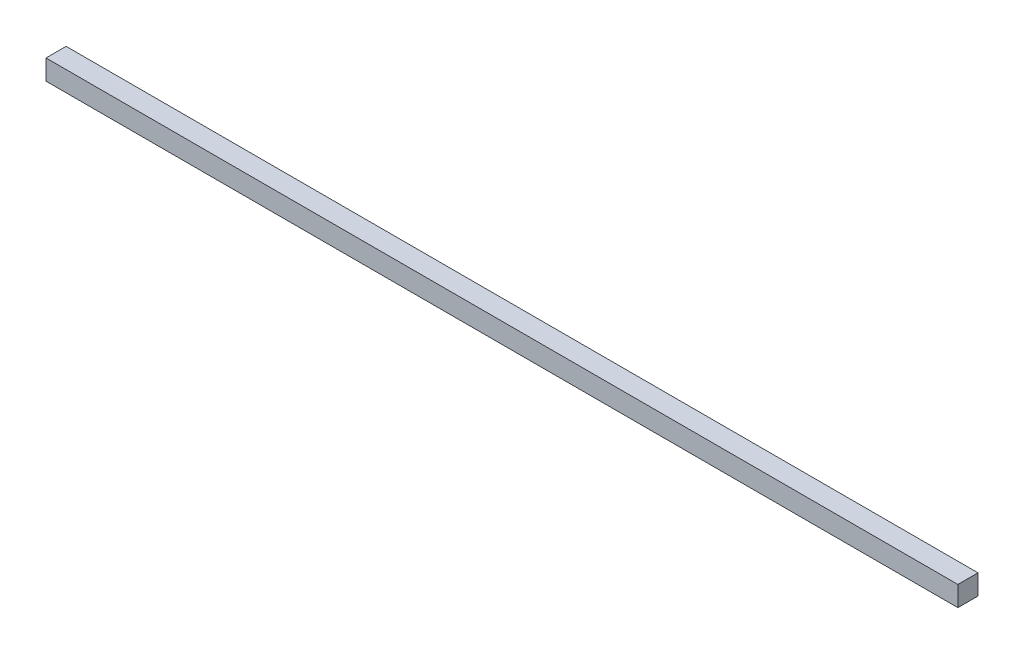
ISO-10303-21;
HEADER;
FILE_DESCRIPTION(('STEP AP214'),'2;1');
FILE_NAME('part.step','',(''),(''),'','','');
FILE_SCHEMA(('AUTOMOTIVE_DESIGN { 1 0 10303 214 1 1 1 1 }'));
ENDSEC;
DATA;
#1=APPLICATION_CONTEXT('core data for automotive mechanical design processes');
#2=APPLICATION_PROTOCOL_DEFINITION('international standard','automotive_design',2000,#1);
#3=PRODUCT_CONTEXT('',#1,'mechanical');
#4=PRODUCT('Part','Part','',(#3));
#5=PRODUCT_RELATED_PRODUCT_CATEGORY('part','',(#4));
#6=PRODUCT_DEFINITION_FORMATION('','',#4);
#7=PRODUCT_DEFINITION_CONTEXT('part definition',#1,'design');
#8=PRODUCT_DEFINITION('design','',#6,#7);
#9=PRODUCT_DEFINITION_SHAPE('','',#8);
#10=(LENGTH_UNIT() NAMED_UNIT(*) SI_UNIT(.MILLI.,.METRE.));
#11=(NAMED_UNIT(*) PLANE_ANGLE_UNIT() SI_UNIT($,.RADIAN.));
#12=(NAMED_UNIT(*) SI_UNIT($,.STERADIAN.) SOLID_ANGLE_UNIT());
#13=UNCERTAINTY_MEASURE_WITH_UNIT(LENGTH_MEASURE(1.E-05),#10,'distance_accuracy_value','');
#14=(GEOMETRIC_REPRESENTATION_CONTEXT(3) GLOBAL_UNCERTAINTY_ASSIGNED_CONTEXT((#13)) GLOBAL_UNIT_ASSIGNED_CONTEXT((#10,
#11,#12)) REPRESENTATION_CONTEXT('',''));
#15=CARTESIAN_POINT('',(0.,0.,0.));
#16=DIRECTION('',(0.,0.,1.));
#17=DIRECTION('',(1.,0.,0.));
#18=AXIS2_PLACEMENT_3D('',#15,#16,#17);
#19=CARTESIAN_POINT('',(52.6371308016878,-0.0100000000000031,-44.8481012658228));
#20=DIRECTION('',(0.,0.,1.));
#21=DIRECTION('',(1.,0.,0.));
#22=AXIS2_PLACEMENT_3D('',#19,#20,#21);
#23=PLANE('',#22);
#24=DIRECTION('',(0.,1.,0.));
#25=VECTOR('',#24,1.);
#26=CARTESIAN_POINT('',(-83.3544303797469,-0.0100000000000031,-44.8481012658228));
#27=LINE('',#26,#25);
#28=CARTESIAN_POINT('',(-83.3544303797469,0.,-44.8481012658228));
#29=VERTEX_POINT('',#28);
#30=CARTESIAN_POINT('',(-83.3544303797469,3.,-44.8481012658228));
#31=VERTEX_POINT('',#30);
#32=EDGE_CURVE('E11',#29,#31,#27,.T.);
#33=ORIENTED_EDGE('',*,*,#32,.F.);
#34=DIRECTION('',(1.,0.,0.));
#35=VECTOR('',#34,1.);
#36=CARTESIAN_POINT('',(0.,0.,-44.8481012658228));
#37=LINE('',#36,#35);
#38=CARTESIAN_POINT('',(52.6371308016878,0.,-44.8481012658228));
#39=VERTEX_POINT('',#38);
#40=EDGE_CURVE('E36',#29,#39,#37,.T.);
#41=ORIENTED_EDGE('',*,*,#40,.T.);
#42=DIRECTION('',(0.,1.,0.));
#43=VECTOR('',#42,1.);
#44=CARTESIAN_POINT('',(52.6371308016878,-0.0100000000000031,-44.8481012658228));
#45=LINE('',#44,#43);
#46=CARTESIAN_POINT('',(52.6371308016878,3.,-44.8481012658228));
#47=VERTEX_POINT('',#46);
#48=EDGE_CURVE('E41',#39,#47,#45,.T.);
#49=ORIENTED_EDGE('',*,*,#48,.T.);
#50=DIRECTION('',(1.,0.,0.));
#51=VECTOR('',#50,1.);
#52=CARTESIAN_POINT('',(0.,3.,-44.8481012658228));
#53=LINE('',#52,#51);
#54=EDGE_CURVE('E95',#31,#47,#53,.T.);
#55=ORIENTED_EDGE('',*,*,#54,.F.);
#56=EDGE_LOOP('',(#33,#41,#49,#55));
#57=FACE_BOUND('',#56,.T.);
#58=ADVANCED_FACE('F32',(#57),#23,.T.);
#59=CARTESIAN_POINT('',(-83.3544303797469,-0.0100000000000031,-44.8481012658228));
#60=DIRECTION('',(-1.,0.,0.));
#61=DIRECTION('',(0.,0.,1.));
#62=AXIS2_PLACEMENT_3D('',#59,#60,#61);
#63=PLANE('',#62);
#64=DIRECTION('',(0.,-1.,0.));
#65=VECTOR('',#64,1.);
#66=CARTESIAN_POINT('',(-83.3544303797469,50.,-47.8481012658228));
#67=LINE('',#66,#65);
#68=CARTESIAN_POINT('',(-83.3544303797469,3.,-47.8481012658228));
#69=VERTEX_POINT('',#68);
#70=CARTESIAN_POINT('',(-83.3544303797469,0.,-47.8481012658228));
#71=VERTEX_POINT('',#70);
#72=EDGE_CURVE('E89',#69,#71,#67,.T.);
#73=ORIENTED_EDGE('',*,*,#72,.T.);
#74=DIRECTION('',(0.,0.,1.));
#75=VECTOR('',#74,1.);
#76=CARTESIAN_POINT('',(-83.3544303797469,0.,0.));
#77=LINE('',#76,#75);
#78=EDGE_CURVE('E78',#71,#29,#77,.T.);
#79=ORIENTED_EDGE('',*,*,#78,.T.);
#80=ORIENTED_EDGE('',*,*,#32,.T.);
#81=DIRECTION('',(0.,0.,1.));
#82=VECTOR('',#81,1.);
#83=CARTESIAN_POINT('',(-83.3544303797469,3.,0.));
#84=LINE('',#83,#82);
#85=EDGE_CURVE('E99',#69,#31,#84,.T.);
#86=ORIENTED_EDGE('',*,*,#85,.F.);
#87=EDGE_LOOP('',(#73,#79,#80,#86));
#88=FACE_BOUND('',#87,.T.);
#89=ADVANCED_FACE('F106',(#88),#63,.T.);
#90=CARTESIAN_POINT('',(52.6371308016878,-0.0100000000000031,-44.8481012658228));
#91=DIRECTION('',(1.,0.,0.));
#92=DIRECTION('',(0.,0.,-1.));
#93=AXIS2_PLACEMENT_3D('',#90,#91,#92);
#94=PLANE('',#93);
#95=ORIENTED_EDGE('',*,*,#48,.F.);
#96=DIRECTION('',(0.,0.,-1.));
#97=VECTOR('',#96,1.);
#98=CARTESIAN_POINT('',(52.6371308016878,0.,0.));
#99=LINE('',#98,#97);
#100=CARTESIAN_POINT('',(52.6371308016878,0.,-47.8481012658228));
#101=VERTEX_POINT('',#100);
#102=EDGE_CURVE('E76',#39,#101,#99,.T.);
#103=ORIENTED_EDGE('',*,*,#102,.T.);
#104=DIRECTION('',(0.,1.,0.));
#105=VECTOR('',#104,1.);
#106=CARTESIAN_POINT('',(52.6371308016878,-0.0100000000000031,-47.8481012658228));
#107=LINE('',#106,#105);
#108=CARTESIAN_POINT('',(52.6371308016878,3.,-47.8481012658228));
#109=VERTEX_POINT('',#108);
#110=EDGE_CURVE('E85',#101,#109,#107,.T.);
#111=ORIENTED_EDGE('',*,*,#110,.T.);
#112=DIRECTION('',(0.,0.,-1.));
#113=VECTOR('',#112,1.);
#114=CARTESIAN_POINT('',(52.6371308016878,3.,0.));
#115=LINE('',#114,#113);
#116=EDGE_CURVE('E88',#47,#109,#115,.T.);
#117=ORIENTED_EDGE('',*,*,#116,.F.);
#118=EDGE_LOOP('',(#95,#103,#111,#117));
#119=FACE_BOUND('',#118,.T.);
#120=ADVANCED_FACE('F91',(#119),#94,.T.);
#121=CARTESIAN_POINT('',(0.,0.,0.));
#122=DIRECTION('',(0.,1.,0.));
#123=DIRECTION('',(0.,0.,1.));
#124=AXIS2_PLACEMENT_3D('',#121,#122,#123);
#125=PLANE('',#124);
#126=ORIENTED_EDGE('',*,*,#102,.F.);
#127=ORIENTED_EDGE('',*,*,#40,.F.);
#128=ORIENTED_EDGE('',*,*,#78,.F.);
#129=DIRECTION('',(-1.,0.,0.));
#130=VECTOR('',#129,1.);
#131=CARTESIAN_POINT('',(-98.3544303797468,0.,-47.8481012658228));
#132=LINE('',#131,#130);
#133=EDGE_CURVE('E73',#101,#71,#132,.T.);
#134=ORIENTED_EDGE('',*,*,#133,.F.);
#135=EDGE_LOOP('',(#126,#127,#128,#134));
#136=FACE_BOUND('',#135,.T.);
#137=ADVANCED_FACE('F75',(#136),#125,.F.);
#138=CARTESIAN_POINT('',(-98.3544303797468,50.,-47.8481012658228));
#139=DIRECTION('',(0.,0.,1.));
#140=DIRECTION('',(1.,0.,0.));
#141=AXIS2_PLACEMENT_3D('',#138,#139,#140);
#142=PLANE('',#141);
#143=ORIENTED_EDGE('',*,*,#110,.F.);
#144=ORIENTED_EDGE('',*,*,#133,.T.);
#145=ORIENTED_EDGE('',*,*,#72,.F.);
#146=DIRECTION('',(1.,0.,0.));
#147=VECTOR('',#146,1.);
#148=CARTESIAN_POINT('',(-98.3544303797468,3.,-47.8481012658228));
#149=LINE('',#148,#147);
#150=EDGE_CURVE('E82',#69,#109,#149,.T.);
#151=ORIENTED_EDGE('',*,*,#150,.T.);
#152=EDGE_LOOP('',(#143,#144,#145,#151));
#153=FACE_BOUND('',#152,.T.);
#154=ADVANCED_FACE('F86',(#153),#142,.F.);
#155=CARTESIAN_POINT('',(0.,3.,0.));
#156=DIRECTION('',(0.,1.,0.));
#157=DIRECTION('',(0.,0.,1.));
#158=AXIS2_PLACEMENT_3D('',#155,#156,#157);
#159=PLANE('',#158);
#160=ORIENTED_EDGE('',*,*,#54,.T.);
#161=ORIENTED_EDGE('',*,*,#116,.T.);
#162=ORIENTED_EDGE('',*,*,#150,.F.);
#163=ORIENTED_EDGE('',*,*,#85,.T.);
#164=EDGE_LOOP('',(#160,#161,#162,#163));
#165=FACE_BOUND('',#164,.T.);
#166=ADVANCED_FACE('F34',(#165),#159,.T.);
#167=CLOSED_SHELL('',(#58,#89,#120,#137,#154,#166));
#168=MANIFOLD_SOLID_BREP('B2',#167);
#169=ADVANCED_BREP_SHAPE_REPRESENTATION('',(#18,#168),#14);
#170=SHAPE_DEFINITION_REPRESENTATION(#9,#169);
ENDSEC;
END-ISO-10303-21;
